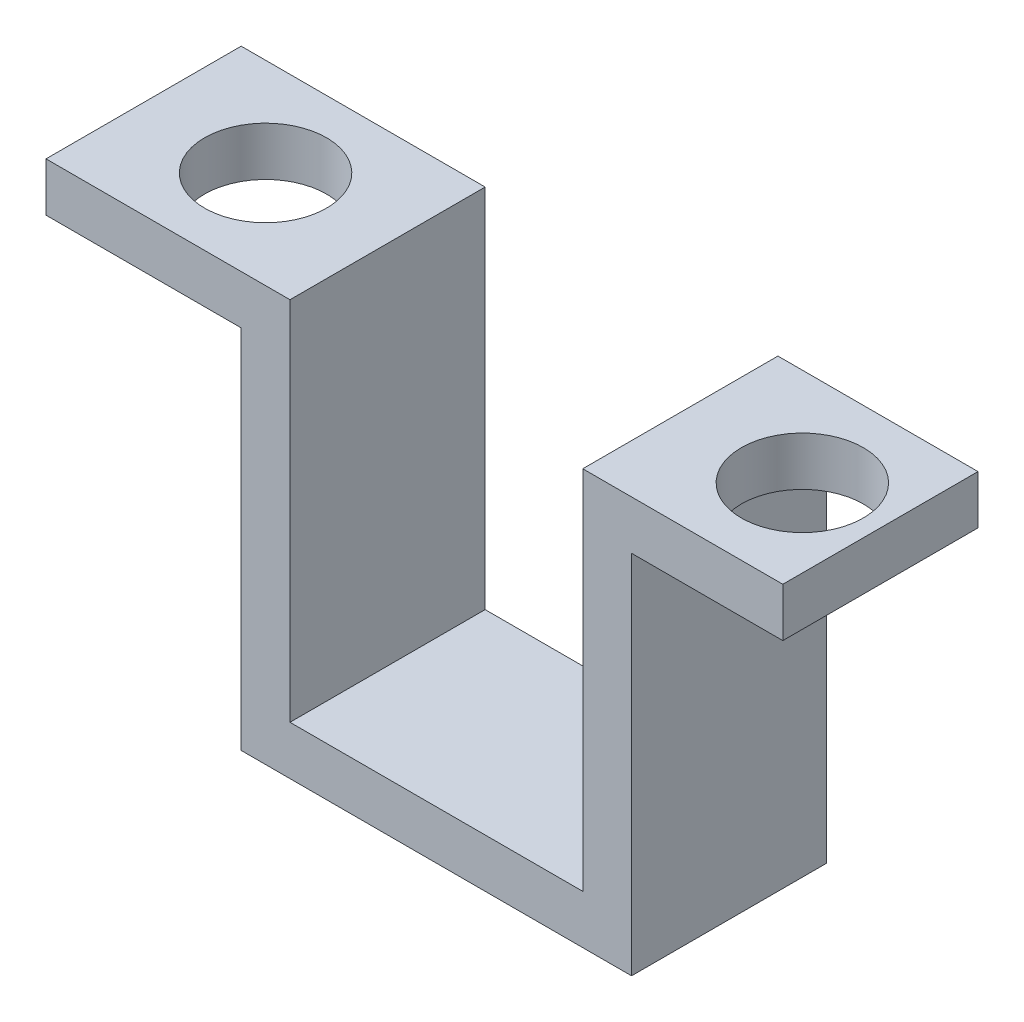
ISO-10303-21;
HEADER;
FILE_DESCRIPTION(('STEP AP214'),'2;1');
FILE_NAME('part.step','',(''),(''),'','','');
FILE_SCHEMA(('AUTOMOTIVE_DESIGN { 1 0 10303 214 1 1 1 1 }'));
ENDSEC;
DATA;
#1=APPLICATION_CONTEXT('core data for automotive mechanical design processes');
#2=APPLICATION_PROTOCOL_DEFINITION('international standard','automotive_design',2000,#1);
#3=PRODUCT_CONTEXT('',#1,'mechanical');
#4=PRODUCT('Part','Part','',(#3));
#5=PRODUCT_RELATED_PRODUCT_CATEGORY('part','',(#4));
#6=PRODUCT_DEFINITION_FORMATION('','',#4);
#7=PRODUCT_DEFINITION_CONTEXT('part definition',#1,'design');
#8=PRODUCT_DEFINITION('design','',#6,#7);
#9=PRODUCT_DEFINITION_SHAPE('','',#8);
#10=(LENGTH_UNIT() NAMED_UNIT(*) SI_UNIT(.MILLI.,.METRE.));
#11=(NAMED_UNIT(*) PLANE_ANGLE_UNIT() SI_UNIT($,.RADIAN.));
#12=(NAMED_UNIT(*) SI_UNIT($,.STERADIAN.) SOLID_ANGLE_UNIT());
#13=UNCERTAINTY_MEASURE_WITH_UNIT(LENGTH_MEASURE(1.E-05),#10,'distance_accuracy_value','');
#14=(GEOMETRIC_REPRESENTATION_CONTEXT(3) GLOBAL_UNCERTAINTY_ASSIGNED_CONTEXT((#13)) GLOBAL_UNIT_ASSIGNED_CONTEXT((#10,
#11,#12)) REPRESENTATION_CONTEXT('',''));
#15=CARTESIAN_POINT('',(0.,0.,0.));
#16=DIRECTION('',(0.,0.,1.));
#17=DIRECTION('',(1.,0.,0.));
#18=AXIS2_PLACEMENT_3D('',#15,#16,#17);
#19=CARTESIAN_POINT('',(0.,5.5,8.));
#20=DIRECTION('',(0.,1.,0.));
#21=DIRECTION('',(0.,0.,1.));
#22=AXIS2_PLACEMENT_3D('',#19,#20,#21);
#23=PLANE('',#22);
#24=CARTESIAN_POINT('',(11.,5.5,4.));
#25=DIRECTION('',(0.,1.,0.));
#26=DIRECTION('',(-1.,0.,0.));
#27=AXIS2_PLACEMENT_3D('',#24,#25,#26);
#28=CIRCLE('',#27,2.5);
#29=CARTESIAN_POINT('',(8.5,5.5,4.));
#30=VERTEX_POINT('',#29);
#31=EDGE_CURVE('E253',#30,#30,#28,.T.);
#32=ORIENTED_EDGE('',*,*,#31,.T.);
#33=EDGE_LOOP('',(#32));
#34=FACE_BOUND('',#33,.T.);
#35=DIRECTION('',(0.,0.,-1.));
#36=VECTOR('',#35,1.);
#37=CARTESIAN_POINT('',(14.2,5.5,8.));
#38=LINE('',#37,#36);
#39=CARTESIAN_POINT('',(14.2,5.5,8.));
#40=VERTEX_POINT('',#39);
#41=CARTESIAN_POINT('',(14.2,5.5,0.));
#42=VERTEX_POINT('',#41);
#43=EDGE_CURVE('E54',#40,#42,#38,.T.);
#44=ORIENTED_EDGE('',*,*,#43,.F.);
#45=DIRECTION('',(1.,0.,0.));
#46=VECTOR('',#45,1.);
#47=CARTESIAN_POINT('',(0.,5.5,8.));
#48=LINE('',#47,#46);
#49=CARTESIAN_POINT('',(8.,5.5,8.));
#50=VERTEX_POINT('',#49);
#51=EDGE_CURVE('E230',#50,#40,#48,.T.);
#52=ORIENTED_EDGE('',*,*,#51,.F.);
#53=DIRECTION('',(0.,0.,-1.));
#54=VECTOR('',#53,1.);
#55=CARTESIAN_POINT('',(8.,5.5,8.));
#56=LINE('',#55,#54);
#57=CARTESIAN_POINT('',(8.,5.5,0.));
#58=VERTEX_POINT('',#57);
#59=EDGE_CURVE('E193',#50,#58,#56,.T.);
#60=ORIENTED_EDGE('',*,*,#59,.T.);
#61=DIRECTION('',(1.,0.,0.));
#62=VECTOR('',#61,1.);
#63=CARTESIAN_POINT('',(0.,5.5,0.));
#64=LINE('',#63,#62);
#65=EDGE_CURVE('E180',#58,#42,#64,.T.);
#66=ORIENTED_EDGE('',*,*,#65,.T.);
#67=EDGE_LOOP('',(#44,#52,#60,#66));
#68=FACE_BOUND('',#67,.T.);
#69=ADVANCED_FACE('F39',(#34,#68),#23,.F.);
#70=CARTESIAN_POINT('',(0.,7.49999999999999,8.));
#71=DIRECTION('',(0.,-1.,0.));
#72=DIRECTION('',(1.,0.,0.));
#73=AXIS2_PLACEMENT_3D('',#70,#71,#72);
#74=PLANE('',#73);
#75=CARTESIAN_POINT('',(11.,7.5,4.));
#76=DIRECTION('',(0.,1.,0.));
#77=DIRECTION('',(-1.,0.,0.));
#78=AXIS2_PLACEMENT_3D('',#75,#76,#77);
#79=CIRCLE('',#78,2.5);
#80=CARTESIAN_POINT('',(8.5,7.5,4.));
#81=VERTEX_POINT('',#80);
#82=EDGE_CURVE('E247',#81,#81,#79,.T.);
#83=ORIENTED_EDGE('',*,*,#82,.F.);
#84=EDGE_LOOP('',(#83));
#85=FACE_BOUND('',#84,.T.);
#86=DIRECTION('',(0.,0.,1.));
#87=VECTOR('',#86,1.);
#88=CARTESIAN_POINT('',(14.2,7.5,8.));
#89=LINE('',#88,#87);
#90=CARTESIAN_POINT('',(14.2,7.5,0.));
#91=VERTEX_POINT('',#90);
#92=CARTESIAN_POINT('',(14.2,7.5,8.));
#93=VERTEX_POINT('',#92);
#94=EDGE_CURVE('E241',#91,#93,#89,.T.);
#95=ORIENTED_EDGE('',*,*,#94,.F.);
#96=DIRECTION('',(-1.,0.,0.));
#97=VECTOR('',#96,1.);
#98=CARTESIAN_POINT('',(0.,7.49999999999999,0.));
#99=LINE('',#98,#97);
#100=CARTESIAN_POINT('',(6.,7.5,0.));
#101=VERTEX_POINT('',#100);
#102=EDGE_CURVE('E183',#91,#101,#99,.T.);
#103=ORIENTED_EDGE('',*,*,#102,.T.);
#104=DIRECTION('',(0.,0.,-1.));
#105=VECTOR('',#104,1.);
#106=CARTESIAN_POINT('',(6.,7.5,8.));
#107=LINE('',#106,#105);
#108=CARTESIAN_POINT('',(6.,7.5,8.));
#109=VERTEX_POINT('',#108);
#110=EDGE_CURVE('E144',#109,#101,#107,.T.);
#111=ORIENTED_EDGE('',*,*,#110,.F.);
#112=DIRECTION('',(-1.,0.,0.));
#113=VECTOR('',#112,1.);
#114=CARTESIAN_POINT('',(0.,7.49999999999999,8.));
#115=LINE('',#114,#113);
#116=EDGE_CURVE('E152',#93,#109,#115,.T.);
#117=ORIENTED_EDGE('',*,*,#116,.F.);
#118=EDGE_LOOP('',(#95,#103,#111,#117));
#119=FACE_BOUND('',#118,.T.);
#120=ADVANCED_FACE('F262',(#85,#119),#74,.F.);
#121=CARTESIAN_POINT('',(0.,0.,8.));
#122=DIRECTION('',(0.,0.,1.));
#123=DIRECTION('',(1.,0.,0.));
#124=AXIS2_PLACEMENT_3D('',#121,#122,#123);
#125=PLANE('',#124);
#126=ORIENTED_EDGE('',*,*,#51,.T.);
#127=DIRECTION('',(0.,-1.,0.));
#128=VECTOR('',#127,1.);
#129=CARTESIAN_POINT('',(14.2,7.5,8.));
#130=LINE('',#129,#128);
#131=EDGE_CURVE('E234',#93,#40,#130,.T.);
#132=ORIENTED_EDGE('',*,*,#131,.F.);
#133=ORIENTED_EDGE('',*,*,#116,.T.);
#134=DIRECTION('',(0.,1.,0.));
#135=VECTOR('',#134,1.);
#136=CARTESIAN_POINT('',(6.,0.,8.));
#137=LINE('',#136,#135);
#138=CARTESIAN_POINT('',(6.,-7.5,8.));
#139=VERTEX_POINT('',#138);
#140=EDGE_CURVE('E137',#139,#109,#137,.T.);
#141=ORIENTED_EDGE('',*,*,#140,.F.);
#142=DIRECTION('',(1.,0.,0.));
#143=VECTOR('',#142,1.);
#144=CARTESIAN_POINT('',(0.,-7.5,8.));
#145=LINE('',#144,#143);
#146=CARTESIAN_POINT('',(-6.,-7.5,8.));
#147=VERTEX_POINT('',#146);
#148=EDGE_CURVE('E149',#147,#139,#145,.T.);
#149=ORIENTED_EDGE('',*,*,#148,.F.);
#150=DIRECTION('',(0.,1.,0.));
#151=VECTOR('',#150,1.);
#152=CARTESIAN_POINT('',(-6.,0.,8.));
#153=LINE('',#152,#151);
#154=CARTESIAN_POINT('',(-6.,7.5,8.));
#155=VERTEX_POINT('',#154);
#156=EDGE_CURVE('E63',#147,#155,#153,.T.);
#157=ORIENTED_EDGE('',*,*,#156,.T.);
#158=DIRECTION('',(-1.,0.,0.));
#159=VECTOR('',#158,1.);
#160=CARTESIAN_POINT('',(0.,7.5,8.));
#161=LINE('',#160,#159);
#162=CARTESIAN_POINT('',(-16.,7.5,8.));
#163=VERTEX_POINT('',#162);
#164=EDGE_CURVE('E189',#155,#163,#161,.T.);
#165=ORIENTED_EDGE('',*,*,#164,.T.);
#166=DIRECTION('',(0.,-1.,0.));
#167=VECTOR('',#166,1.);
#168=CARTESIAN_POINT('',(-16.,0.,8.));
#169=LINE('',#168,#167);
#170=CARTESIAN_POINT('',(-16.,5.5,8.));
#171=VERTEX_POINT('',#170);
#172=EDGE_CURVE('E110',#163,#171,#169,.T.);
#173=ORIENTED_EDGE('',*,*,#172,.T.);
#174=DIRECTION('',(-1.,0.,0.));
#175=VECTOR('',#174,1.);
#176=CARTESIAN_POINT('',(0.,5.5,8.));
#177=LINE('',#176,#175);
#178=CARTESIAN_POINT('',(-8.,5.5,8.));
#179=VERTEX_POINT('',#178);
#180=EDGE_CURVE('E205',#179,#171,#177,.T.);
#181=ORIENTED_EDGE('',*,*,#180,.F.);
#182=DIRECTION('',(0.,-1.,0.));
#183=VECTOR('',#182,1.);
#184=CARTESIAN_POINT('',(-8.,0.,8.));
#185=LINE('',#184,#183);
#186=CARTESIAN_POINT('',(-8.,-9.50000000000001,8.));
#187=VERTEX_POINT('',#186);
#188=EDGE_CURVE('E218',#179,#187,#185,.T.);
#189=ORIENTED_EDGE('',*,*,#188,.T.);
#190=DIRECTION('',(-1.,0.,0.));
#191=VECTOR('',#190,1.);
#192=CARTESIAN_POINT('',(0.,-9.5,8.));
#193=LINE('',#192,#191);
#194=CARTESIAN_POINT('',(8.,-9.5,8.));
#195=VERTEX_POINT('',#194);
#196=EDGE_CURVE('E220',#195,#187,#193,.T.);
#197=ORIENTED_EDGE('',*,*,#196,.F.);
#198=DIRECTION('',(0.,-1.,0.));
#199=VECTOR('',#198,1.);
#200=CARTESIAN_POINT('',(8.,0.,8.));
#201=LINE('',#200,#199);
#202=EDGE_CURVE('E227',#50,#195,#201,.T.);
#203=ORIENTED_EDGE('',*,*,#202,.F.);
#204=EDGE_LOOP('',(#126,#132,#133,#141,#149,#157,#165,#173,#181,#189,#197,#203));
#205=FACE_BOUND('',#204,.T.);
#206=ADVANCED_FACE('F148',(#205),#125,.T.);
#207=CARTESIAN_POINT('',(0.,0.,0.));
#208=DIRECTION('',(0.,0.,1.));
#209=DIRECTION('',(1.,0.,0.));
#210=AXIS2_PLACEMENT_3D('',#207,#208,#209);
#211=PLANE('',#210);
#212=DIRECTION('',(0.,1.,0.));
#213=VECTOR('',#212,1.);
#214=CARTESIAN_POINT('',(14.2,7.5,0.));
#215=LINE('',#214,#213);
#216=EDGE_CURVE('E239',#42,#91,#215,.T.);
#217=ORIENTED_EDGE('',*,*,#216,.F.);
#218=ORIENTED_EDGE('',*,*,#65,.F.);
#219=DIRECTION('',(0.,-1.,0.));
#220=VECTOR('',#219,1.);
#221=CARTESIAN_POINT('',(8.,0.,0.));
#222=LINE('',#221,#220);
#223=CARTESIAN_POINT('',(8.,-9.5,0.));
#224=VERTEX_POINT('',#223);
#225=EDGE_CURVE('E177',#58,#224,#222,.T.);
#226=ORIENTED_EDGE('',*,*,#225,.T.);
#227=DIRECTION('',(-1.,0.,0.));
#228=VECTOR('',#227,1.);
#229=CARTESIAN_POINT('',(0.,-9.5,0.));
#230=LINE('',#229,#228);
#231=CARTESIAN_POINT('',(-8.,-9.50000000000001,0.));
#232=VERTEX_POINT('',#231);
#233=EDGE_CURVE('E174',#224,#232,#230,.T.);
#234=ORIENTED_EDGE('',*,*,#233,.T.);
#235=DIRECTION('',(0.,-1.,0.));
#236=VECTOR('',#235,1.);
#237=CARTESIAN_POINT('',(-8.,0.,0.));
#238=LINE('',#237,#236);
#239=CARTESIAN_POINT('',(-8.,5.5,0.));
#240=VERTEX_POINT('',#239);
#241=EDGE_CURVE('E171',#240,#232,#238,.T.);
#242=ORIENTED_EDGE('',*,*,#241,.F.);
#243=DIRECTION('',(-1.,0.,0.));
#244=VECTOR('',#243,1.);
#245=CARTESIAN_POINT('',(0.,5.5,0.));
#246=LINE('',#245,#244);
#247=CARTESIAN_POINT('',(-16.,5.5,0.));
#248=VERTEX_POINT('',#247);
#249=EDGE_CURVE('E168',#240,#248,#246,.T.);
#250=ORIENTED_EDGE('',*,*,#249,.T.);
#251=DIRECTION('',(0.,-1.,0.));
#252=VECTOR('',#251,1.);
#253=CARTESIAN_POINT('',(-16.,0.,0.));
#254=LINE('',#253,#252);
#255=CARTESIAN_POINT('',(-16.,7.5,0.));
#256=VERTEX_POINT('',#255);
#257=EDGE_CURVE('E164',#256,#248,#254,.T.);
#258=ORIENTED_EDGE('',*,*,#257,.F.);
#259=DIRECTION('',(-1.,0.,0.));
#260=VECTOR('',#259,1.);
#261=CARTESIAN_POINT('',(0.,7.5,0.));
#262=LINE('',#261,#260);
#263=CARTESIAN_POINT('',(-6.,7.5,0.));
#264=VERTEX_POINT('',#263);
#265=EDGE_CURVE('E161',#264,#256,#262,.T.);
#266=ORIENTED_EDGE('',*,*,#265,.F.);
#267=DIRECTION('',(0.,1.,0.));
#268=VECTOR('',#267,1.);
#269=CARTESIAN_POINT('',(-6.,0.,0.));
#270=LINE('',#269,#268);
#271=CARTESIAN_POINT('',(-6.,-7.5,0.));
#272=VERTEX_POINT('',#271);
#273=EDGE_CURVE('E102',#272,#264,#270,.T.);
#274=ORIENTED_EDGE('',*,*,#273,.F.);
#275=DIRECTION('',(1.,0.,0.));
#276=VECTOR('',#275,1.);
#277=CARTESIAN_POINT('',(0.,-7.5,0.));
#278=LINE('',#277,#276);
#279=CARTESIAN_POINT('',(6.,-7.5,0.));
#280=VERTEX_POINT('',#279);
#281=EDGE_CURVE('E186',#272,#280,#278,.T.);
#282=ORIENTED_EDGE('',*,*,#281,.T.);
#283=DIRECTION('',(0.,1.,0.));
#284=VECTOR('',#283,1.);
#285=CARTESIAN_POINT('',(6.,0.,0.));
#286=LINE('',#285,#284);
#287=EDGE_CURVE('E139',#280,#101,#286,.T.);
#288=ORIENTED_EDGE('',*,*,#287,.T.);
#289=ORIENTED_EDGE('',*,*,#102,.F.);
#290=EDGE_LOOP('',(#217,#218,#226,#234,#242,#250,#258,#266,#274,#282,#288,#289));
#291=FACE_BOUND('',#290,.T.);
#292=ADVANCED_FACE('F211',(#291),#211,.F.);
#293=CARTESIAN_POINT('',(0.,7.5,8.));
#294=DIRECTION('',(0.,-1.,0.));
#295=DIRECTION('',(1.,0.,0.));
#296=AXIS2_PLACEMENT_3D('',#293,#294,#295);
#297=PLANE('',#296);
#298=CARTESIAN_POINT('',(-11.,7.49999999999998,4.));
#299=DIRECTION('',(0.,1.,0.));
#300=DIRECTION('',(-1.,0.,0.));
#301=AXIS2_PLACEMENT_3D('',#298,#299,#300);
#302=CIRCLE('',#301,2.5);
#303=CARTESIAN_POINT('',(-13.5,7.49999999999998,4.));
#304=VERTEX_POINT('',#303);
#305=EDGE_CURVE('E250',#304,#304,#302,.T.);
#306=ORIENTED_EDGE('',*,*,#305,.F.);
#307=EDGE_LOOP('',(#306));
#308=FACE_BOUND('',#307,.T.);
#309=ORIENTED_EDGE('',*,*,#265,.T.);
#310=DIRECTION('',(0.,0.,-1.));
#311=VECTOR('',#310,1.);
#312=CARTESIAN_POINT('',(-16.,7.5,8.));
#313=LINE('',#312,#311);
#314=EDGE_CURVE('E11',#163,#256,#313,.T.);
#315=ORIENTED_EDGE('',*,*,#314,.F.);
#316=ORIENTED_EDGE('',*,*,#164,.F.);
#317=DIRECTION('',(0.,0.,-1.));
#318=VECTOR('',#317,1.);
#319=CARTESIAN_POINT('',(-6.,7.5,8.));
#320=LINE('',#319,#318);
#321=EDGE_CURVE('E157',#155,#264,#320,.T.);
#322=ORIENTED_EDGE('',*,*,#321,.T.);
#323=EDGE_LOOP('',(#309,#315,#316,#322));
#324=FACE_BOUND('',#323,.T.);
#325=ADVANCED_FACE('F41',(#308,#324),#297,.F.);
#326=CARTESIAN_POINT('',(-16.,0.,8.));
#327=DIRECTION('',(1.,0.,0.));
#328=DIRECTION('',(0.,0.,-1.));
#329=AXIS2_PLACEMENT_3D('',#326,#327,#328);
#330=PLANE('',#329);
#331=ORIENTED_EDGE('',*,*,#257,.T.);
#332=DIRECTION('',(0.,0.,-1.));
#333=VECTOR('',#332,1.);
#334=CARTESIAN_POINT('',(-16.,5.5,8.));
#335=LINE('',#334,#333);
#336=EDGE_CURVE('E47',#171,#248,#335,.T.);
#337=ORIENTED_EDGE('',*,*,#336,.F.);
#338=ORIENTED_EDGE('',*,*,#172,.F.);
#339=ORIENTED_EDGE('',*,*,#314,.T.);
#340=EDGE_LOOP('',(#331,#337,#338,#339));
#341=FACE_BOUND('',#340,.T.);
#342=ADVANCED_FACE('F206',(#341),#330,.F.);
#343=CARTESIAN_POINT('',(0.,5.5,8.));
#344=DIRECTION('',(0.,-1.,0.));
#345=DIRECTION('',(1.,0.,0.));
#346=AXIS2_PLACEMENT_3D('',#343,#344,#345);
#347=PLANE('',#346);
#348=CARTESIAN_POINT('',(-11.,5.49999999999998,4.));
#349=DIRECTION('',(0.,1.,0.));
#350=DIRECTION('',(-1.,0.,0.));
#351=AXIS2_PLACEMENT_3D('',#348,#349,#350);
#352=CIRCLE('',#351,2.5);
#353=CARTESIAN_POINT('',(-13.5,5.49999999999998,4.));
#354=VERTEX_POINT('',#353);
#355=EDGE_CURVE('E165',#354,#354,#352,.T.);
#356=ORIENTED_EDGE('',*,*,#355,.T.);
#357=EDGE_LOOP('',(#356));
#358=FACE_BOUND('',#357,.T.);
#359=ORIENTED_EDGE('',*,*,#249,.F.);
#360=DIRECTION('',(0.,0.,-1.));
#361=VECTOR('',#360,1.);
#362=CARTESIAN_POINT('',(-8.,5.5,8.));
#363=LINE('',#362,#361);
#364=EDGE_CURVE('E199',#179,#240,#363,.T.);
#365=ORIENTED_EDGE('',*,*,#364,.F.);
#366=ORIENTED_EDGE('',*,*,#180,.T.);
#367=ORIENTED_EDGE('',*,*,#336,.T.);
#368=EDGE_LOOP('',(#359,#365,#366,#367));
#369=FACE_BOUND('',#368,.T.);
#370=ADVANCED_FACE('F203',(#358,#369),#347,.T.);
#371=CARTESIAN_POINT('',(-8.,0.,8.));
#372=DIRECTION('',(1.,0.,0.));
#373=DIRECTION('',(0.,0.,-1.));
#374=AXIS2_PLACEMENT_3D('',#371,#372,#373);
#375=PLANE('',#374);
#376=ORIENTED_EDGE('',*,*,#241,.T.);
#377=DIRECTION('',(0.,0.,-1.));
#378=VECTOR('',#377,1.);
#379=CARTESIAN_POINT('',(-8.,-9.50000000000001,8.));
#380=LINE('',#379,#378);
#381=EDGE_CURVE('E197',#187,#232,#380,.T.);
#382=ORIENTED_EDGE('',*,*,#381,.F.);
#383=ORIENTED_EDGE('',*,*,#188,.F.);
#384=ORIENTED_EDGE('',*,*,#364,.T.);
#385=EDGE_LOOP('',(#376,#382,#383,#384));
#386=FACE_BOUND('',#385,.T.);
#387=ADVANCED_FACE('F215',(#386),#375,.F.);
#388=CARTESIAN_POINT('',(0.,-9.5,8.));
#389=DIRECTION('',(0.,-1.,0.));
#390=DIRECTION('',(1.,0.,0.));
#391=AXIS2_PLACEMENT_3D('',#388,#389,#390);
#392=PLANE('',#391);
#393=ORIENTED_EDGE('',*,*,#233,.F.);
#394=DIRECTION('',(0.,0.,-1.));
#395=VECTOR('',#394,1.);
#396=CARTESIAN_POINT('',(8.,-9.5,8.));
#397=LINE('',#396,#395);
#398=EDGE_CURVE('E195',#195,#224,#397,.T.);
#399=ORIENTED_EDGE('',*,*,#398,.F.);
#400=ORIENTED_EDGE('',*,*,#196,.T.);
#401=ORIENTED_EDGE('',*,*,#381,.T.);
#402=EDGE_LOOP('',(#393,#399,#400,#401));
#403=FACE_BOUND('',#402,.T.);
#404=ADVANCED_FACE('F288',(#403),#392,.T.);
#405=CARTESIAN_POINT('',(8.,0.,8.));
#406=DIRECTION('',(1.,0.,0.));
#407=DIRECTION('',(0.,1.,0.));
#408=AXIS2_PLACEMENT_3D('',#405,#406,#407);
#409=PLANE('',#408);
#410=ORIENTED_EDGE('',*,*,#225,.F.);
#411=ORIENTED_EDGE('',*,*,#59,.F.);
#412=ORIENTED_EDGE('',*,*,#202,.T.);
#413=ORIENTED_EDGE('',*,*,#398,.T.);
#414=EDGE_LOOP('',(#410,#411,#412,#413));
#415=FACE_BOUND('',#414,.T.);
#416=ADVANCED_FACE('F285',(#415),#409,.T.);
#417=CARTESIAN_POINT('',(6.,0.,8.));
#418=DIRECTION('',(-1.,0.,0.));
#419=DIRECTION('',(0.,0.,1.));
#420=AXIS2_PLACEMENT_3D('',#417,#418,#419);
#421=PLANE('',#420);
#422=ORIENTED_EDGE('',*,*,#287,.F.);
#423=DIRECTION('',(0.,0.,-1.));
#424=VECTOR('',#423,1.);
#425=CARTESIAN_POINT('',(6.,-7.5,8.));
#426=LINE('',#425,#424);
#427=EDGE_CURVE('E133',#139,#280,#426,.T.);
#428=ORIENTED_EDGE('',*,*,#427,.F.);
#429=ORIENTED_EDGE('',*,*,#140,.T.);
#430=ORIENTED_EDGE('',*,*,#110,.T.);
#431=EDGE_LOOP('',(#422,#428,#429,#430));
#432=FACE_BOUND('',#431,.T.);
#433=ADVANCED_FACE('F135',(#432),#421,.T.);
#434=CARTESIAN_POINT('',(0.,-7.5,8.));
#435=DIRECTION('',(0.,1.,0.));
#436=DIRECTION('',(0.,0.,1.));
#437=AXIS2_PLACEMENT_3D('',#434,#435,#436);
#438=PLANE('',#437);
#439=ORIENTED_EDGE('',*,*,#281,.F.);
#440=DIRECTION('',(0.,0.,-1.));
#441=VECTOR('',#440,1.);
#442=CARTESIAN_POINT('',(-6.,-7.5,8.));
#443=LINE('',#442,#441);
#444=EDGE_CURVE('E145',#147,#272,#443,.T.);
#445=ORIENTED_EDGE('',*,*,#444,.F.);
#446=ORIENTED_EDGE('',*,*,#148,.T.);
#447=ORIENTED_EDGE('',*,*,#427,.T.);
#448=EDGE_LOOP('',(#439,#445,#446,#447));
#449=FACE_BOUND('',#448,.T.);
#450=ADVANCED_FACE('F155',(#449),#438,.T.);
#451=CARTESIAN_POINT('',(-6.,0.,8.));
#452=DIRECTION('',(-1.,0.,0.));
#453=DIRECTION('',(0.,0.,1.));
#454=AXIS2_PLACEMENT_3D('',#451,#452,#453);
#455=PLANE('',#454);
#456=ORIENTED_EDGE('',*,*,#273,.T.);
#457=ORIENTED_EDGE('',*,*,#321,.F.);
#458=ORIENTED_EDGE('',*,*,#156,.F.);
#459=ORIENTED_EDGE('',*,*,#444,.T.);
#460=EDGE_LOOP('',(#456,#457,#458,#459));
#461=FACE_BOUND('',#460,.T.);
#462=ADVANCED_FACE('F316',(#461),#455,.F.);
#463=CARTESIAN_POINT('',(11.,5.5,4.));
#464=DIRECTION('',(0.,1.,0.));
#465=DIRECTION('',(-1.,0.,0.));
#466=AXIS2_PLACEMENT_3D('',#463,#464,#465);
#467=CYLINDRICAL_SURFACE('',#466,2.5);
#468=ORIENTED_EDGE('',*,*,#31,.F.);
#469=EDGE_LOOP('',(#468));
#470=FACE_BOUND('',#469,.T.);
#471=ORIENTED_EDGE('',*,*,#82,.T.);
#472=EDGE_LOOP('',(#471));
#473=FACE_BOUND('',#472,.T.);
#474=ADVANCED_FACE('F271',(#470,#473),#467,.F.);
#475=CARTESIAN_POINT('',(-11.,5.49999999999998,4.));
#476=DIRECTION('',(0.,1.,0.));
#477=DIRECTION('',(-1.,0.,0.));
#478=AXIS2_PLACEMENT_3D('',#475,#476,#477);
#479=CYLINDRICAL_SURFACE('',#478,2.5);
#480=ORIENTED_EDGE('',*,*,#355,.F.);
#481=EDGE_LOOP('',(#480));
#482=FACE_BOUND('',#481,.T.);
#483=ORIENTED_EDGE('',*,*,#305,.T.);
#484=EDGE_LOOP('',(#483));
#485=FACE_BOUND('',#484,.T.);
#486=ADVANCED_FACE('F265',(#482,#485),#479,.F.);
#487=CARTESIAN_POINT('',(14.2,0.,0.));
#488=DIRECTION('',(1.,0.,0.));
#489=DIRECTION('',(0.,0.,-1.));
#490=AXIS2_PLACEMENT_3D('',#487,#488,#489);
#491=PLANE('',#490);
#492=ORIENTED_EDGE('',*,*,#131,.T.);
#493=ORIENTED_EDGE('',*,*,#43,.T.);
#494=ORIENTED_EDGE('',*,*,#216,.T.);
#495=ORIENTED_EDGE('',*,*,#94,.T.);
#496=EDGE_LOOP('',(#492,#493,#494,#495));
#497=FACE_BOUND('',#496,.T.);
#498=ADVANCED_FACE('F263',(#497),#491,.T.);
#499=CLOSED_SHELL('',(#69,#120,#206,#292,#325,#342,#370,#387,#404,#416,#433,#450,#462,#474,#486,#498));
#500=MANIFOLD_SOLID_BREP('B2',#499);
#501=ADVANCED_BREP_SHAPE_REPRESENTATION('',(#18,#500),#14);
#502=SHAPE_DEFINITION_REPRESENTATION(#9,#501);
ENDSEC;
END-ISO-10303-21;
